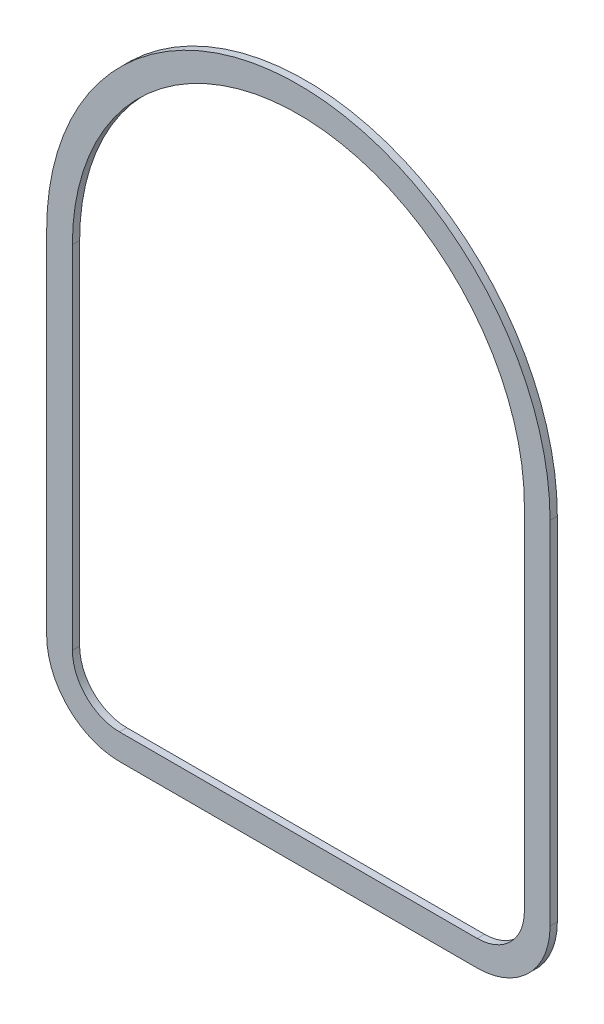
ISO-10303-21;
HEADER;
FILE_DESCRIPTION(('STEP AP214'),'2;1');
FILE_NAME('part.step','',(''),(''),'','','');
FILE_SCHEMA(('AUTOMOTIVE_DESIGN { 1 0 10303 214 1 1 1 1 }'));
ENDSEC;
DATA;
#1=APPLICATION_CONTEXT('core data for automotive mechanical design processes');
#2=APPLICATION_PROTOCOL_DEFINITION('international standard','automotive_design',2000,#1);
#3=PRODUCT_CONTEXT('',#1,'mechanical');
#4=PRODUCT('Part','Part','',(#3));
#5=PRODUCT_RELATED_PRODUCT_CATEGORY('part','',(#4));
#6=PRODUCT_DEFINITION_FORMATION('','',#4);
#7=PRODUCT_DEFINITION_CONTEXT('part definition',#1,'design');
#8=PRODUCT_DEFINITION('design','',#6,#7);
#9=PRODUCT_DEFINITION_SHAPE('','',#8);
#10=(LENGTH_UNIT() NAMED_UNIT(*) SI_UNIT(.MILLI.,.METRE.));
#11=(NAMED_UNIT(*) PLANE_ANGLE_UNIT() SI_UNIT($,.RADIAN.));
#12=(NAMED_UNIT(*) SI_UNIT($,.STERADIAN.) SOLID_ANGLE_UNIT());
#13=UNCERTAINTY_MEASURE_WITH_UNIT(LENGTH_MEASURE(1.E-05),#10,'distance_accuracy_value','');
#14=(GEOMETRIC_REPRESENTATION_CONTEXT(3) GLOBAL_UNCERTAINTY_ASSIGNED_CONTEXT((#13)) GLOBAL_UNIT_ASSIGNED_CONTEXT((#10,
#11,#12)) REPRESENTATION_CONTEXT('',''));
#15=CARTESIAN_POINT('',(0.,0.,0.));
#16=DIRECTION('',(0.,0.,1.));
#17=DIRECTION('',(1.,0.,0.));
#18=AXIS2_PLACEMENT_3D('',#15,#16,#17);
#19=CARTESIAN_POINT('',(340.245573826653,1.17102259932156E-13,10.));
#20=DIRECTION('',(-1.,0.,0.));
#21=DIRECTION('',(0.,-1.,0.));
#22=AXIS2_PLACEMENT_3D('',#19,#20,#21);
#23=PLANE('',#22);
#24=DIRECTION('',(0.,1.,0.));
#25=VECTOR('',#24,1.);
#26=CARTESIAN_POINT('',(340.245573826653,1.17102259932156E-13,0.));
#27=LINE('',#26,#25);
#28=CARTESIAN_POINT('',(340.245573826653,-360.346945871874,0.));
#29=VERTEX_POINT('',#28);
#30=CARTESIAN_POINT('',(340.245573826653,123.523054128126,0.));
#31=VERTEX_POINT('',#30);
#32=EDGE_CURVE('E181',#29,#31,#27,.T.);
#33=ORIENTED_EDGE('',*,*,#32,.T.);
#34=DIRECTION('',(0.,0.,-1.));
#35=VECTOR('',#34,1.);
#36=CARTESIAN_POINT('',(340.245573826653,123.523054128126,10.));
#37=LINE('',#36,#35);
#38=CARTESIAN_POINT('',(340.245573826653,123.523054128126,10.));
#39=VERTEX_POINT('',#38);
#40=EDGE_CURVE('E11',#39,#31,#37,.T.);
#41=ORIENTED_EDGE('',*,*,#40,.F.);
#42=DIRECTION('',(0.,1.,0.));
#43=VECTOR('',#42,1.);
#44=CARTESIAN_POINT('',(340.245573826653,1.17102259932156E-13,10.));
#45=LINE('',#44,#43);
#46=CARTESIAN_POINT('',(340.245573826653,-360.346945871874,10.));
#47=VERTEX_POINT('',#46);
#48=EDGE_CURVE('E240',#47,#39,#45,.T.);
#49=ORIENTED_EDGE('',*,*,#48,.F.);
#50=DIRECTION('',(0.,0.,-1.));
#51=VECTOR('',#50,1.);
#52=CARTESIAN_POINT('',(340.245573826653,-360.346945871874,10.));
#53=LINE('',#52,#51);
#54=EDGE_CURVE('E193',#47,#29,#53,.T.);
#55=ORIENTED_EDGE('',*,*,#54,.T.);
#56=EDGE_LOOP('',(#33,#41,#49,#55));
#57=FACE_BOUND('',#56,.T.);
#58=ADVANCED_FACE('F38',(#57),#23,.F.);
#59=CARTESIAN_POINT('',(-6.46442617334697,123.523054128126,10.));
#60=DIRECTION('',(0.,0.,-1.));
#61=DIRECTION('',(-1.,0.,0.));
#62=AXIS2_PLACEMENT_3D('',#59,#60,#61);
#63=CYLINDRICAL_SURFACE('',#62,346.71);
#64=CARTESIAN_POINT('',(-6.46442617334697,123.523054128126,0.));
#65=DIRECTION('',(0.,0.,1.));
#66=DIRECTION('',(1.,0.,0.));
#67=AXIS2_PLACEMENT_3D('',#64,#65,#66);
#68=CIRCLE('',#67,346.71);
#69=CARTESIAN_POINT('',(-353.174426173347,123.523054128126,0.));
#70=VERTEX_POINT('',#69);
#71=EDGE_CURVE('E184',#31,#70,#68,.T.);
#72=ORIENTED_EDGE('',*,*,#71,.T.);
#73=DIRECTION('',(0.,0.,-1.));
#74=VECTOR('',#73,1.);
#75=CARTESIAN_POINT('',(-353.174426173347,123.523054128126,10.));
#76=LINE('',#75,#74);
#77=CARTESIAN_POINT('',(-353.174426173347,123.523054128126,10.));
#78=VERTEX_POINT('',#77);
#79=EDGE_CURVE('E48',#78,#70,#76,.T.);
#80=ORIENTED_EDGE('',*,*,#79,.F.);
#81=CARTESIAN_POINT('',(-6.46442617334697,123.523054128126,10.));
#82=DIRECTION('',(0.,0.,1.));
#83=DIRECTION('',(1.,0.,0.));
#84=AXIS2_PLACEMENT_3D('',#81,#82,#83);
#85=CIRCLE('',#84,346.71);
#86=EDGE_CURVE('E157',#39,#78,#85,.T.);
#87=ORIENTED_EDGE('',*,*,#86,.F.);
#88=ORIENTED_EDGE('',*,*,#40,.T.);
#89=EDGE_LOOP('',(#72,#80,#87,#88));
#90=FACE_BOUND('',#89,.T.);
#91=ADVANCED_FACE('F245',(#90),#63,.T.);
#92=CARTESIAN_POINT('',(-353.174426173347,0.,10.));
#93=DIRECTION('',(1.,0.,0.));
#94=DIRECTION('',(0.,0.,-1.));
#95=AXIS2_PLACEMENT_3D('',#92,#93,#94);
#96=PLANE('',#95);
#97=DIRECTION('',(0.,-1.,0.));
#98=VECTOR('',#97,1.);
#99=CARTESIAN_POINT('',(-353.174426173347,0.,0.));
#100=LINE('',#99,#98);
#101=CARTESIAN_POINT('',(-353.174426173347,-360.346945871874,0.));
#102=VERTEX_POINT('',#101);
#103=EDGE_CURVE('E186',#70,#102,#100,.T.);
#104=ORIENTED_EDGE('',*,*,#103,.T.);
#105=DIRECTION('',(0.,0.,-1.));
#106=VECTOR('',#105,1.);
#107=CARTESIAN_POINT('',(-353.174426173347,-360.346945871874,10.));
#108=LINE('',#107,#106);
#109=CARTESIAN_POINT('',(-353.174426173347,-360.346945871874,10.));
#110=VERTEX_POINT('',#109);
#111=EDGE_CURVE('E146',#110,#102,#108,.T.);
#112=ORIENTED_EDGE('',*,*,#111,.F.);
#113=DIRECTION('',(0.,-1.,0.));
#114=VECTOR('',#113,1.);
#115=CARTESIAN_POINT('',(-353.174426173347,0.,10.));
#116=LINE('',#115,#114);
#117=EDGE_CURVE('E154',#78,#110,#116,.T.);
#118=ORIENTED_EDGE('',*,*,#117,.F.);
#119=ORIENTED_EDGE('',*,*,#79,.T.);
#120=EDGE_LOOP('',(#104,#112,#118,#119));
#121=FACE_BOUND('',#120,.T.);
#122=ADVANCED_FACE('F248',(#121),#96,.F.);
#123=CARTESIAN_POINT('',(-252.844426173347,-360.346945871874,10.));
#124=DIRECTION('',(0.,0.,-1.));
#125=DIRECTION('',(-1.,0.,0.));
#126=AXIS2_PLACEMENT_3D('',#123,#124,#125);
#127=CYLINDRICAL_SURFACE('',#126,100.33);
#128=CARTESIAN_POINT('',(-252.844426173347,-360.346945871874,0.));
#129=DIRECTION('',(0.,0.,1.));
#130=DIRECTION('',(1.,0.,0.));
#131=AXIS2_PLACEMENT_3D('',#128,#129,#130);
#132=CIRCLE('',#131,100.33);
#133=CARTESIAN_POINT('',(-252.844426173347,-460.676945871874,0.));
#134=VERTEX_POINT('',#133);
#135=EDGE_CURVE('E145',#134,#102,#132,.F.);
#136=ORIENTED_EDGE('',*,*,#135,.F.);
#137=DIRECTION('',(0.,0.,-1.));
#138=VECTOR('',#137,1.);
#139=CARTESIAN_POINT('',(-252.844426173347,-460.676945871874,10.));
#140=LINE('',#139,#138);
#141=CARTESIAN_POINT('',(-252.844426173347,-460.676945871874,10.));
#142=VERTEX_POINT('',#141);
#143=EDGE_CURVE('E139',#142,#134,#140,.T.);
#144=ORIENTED_EDGE('',*,*,#143,.F.);
#145=CARTESIAN_POINT('',(-252.844426173347,-360.346945871874,10.));
#146=DIRECTION('',(0.,0.,1.));
#147=DIRECTION('',(1.,0.,0.));
#148=AXIS2_PLACEMENT_3D('',#145,#146,#147);
#149=CIRCLE('',#148,100.33);
#150=EDGE_CURVE('E143',#142,#110,#149,.F.);
#151=ORIENTED_EDGE('',*,*,#150,.T.);
#152=ORIENTED_EDGE('',*,*,#111,.T.);
#153=EDGE_LOOP('',(#136,#144,#151,#152));
#154=FACE_BOUND('',#153,.T.);
#155=ADVANCED_FACE('F141',(#154),#127,.T.);
#156=CARTESIAN_POINT('',(0.,-460.676945871874,10.));
#157=DIRECTION('',(0.,1.,0.));
#158=DIRECTION('',(-1.,0.,0.));
#159=AXIS2_PLACEMENT_3D('',#156,#157,#158);
#160=PLANE('',#159);
#161=DIRECTION('',(1.,0.,0.));
#162=VECTOR('',#161,1.);
#163=CARTESIAN_POINT('',(0.,-460.676945871874,0.));
#164=LINE('',#163,#162);
#165=CARTESIAN_POINT('',(239.915573826653,-460.676945871874,0.));
#166=VERTEX_POINT('',#165);
#167=EDGE_CURVE('E97',#134,#166,#164,.T.);
#168=ORIENTED_EDGE('',*,*,#167,.T.);
#169=DIRECTION('',(0.,0.,-1.));
#170=VECTOR('',#169,1.);
#171=CARTESIAN_POINT('',(239.915573826653,-460.676945871874,10.));
#172=LINE('',#171,#170);
#173=CARTESIAN_POINT('',(239.915573826653,-460.676945871874,10.));
#174=VERTEX_POINT('',#173);
#175=EDGE_CURVE('E147',#174,#166,#172,.T.);
#176=ORIENTED_EDGE('',*,*,#175,.F.);
#177=DIRECTION('',(1.,0.,0.));
#178=VECTOR('',#177,1.);
#179=CARTESIAN_POINT('',(0.,-460.676945871874,10.));
#180=LINE('',#179,#178);
#181=EDGE_CURVE('E149',#142,#174,#180,.T.);
#182=ORIENTED_EDGE('',*,*,#181,.F.);
#183=ORIENTED_EDGE('',*,*,#143,.T.);
#184=EDGE_LOOP('',(#168,#176,#182,#183));
#185=FACE_BOUND('',#184,.T.);
#186=ADVANCED_FACE('F150',(#185),#160,.F.);
#187=CARTESIAN_POINT('',(-6.46442617334697,123.523054128126,10.));
#188=DIRECTION('',(0.,0.,-1.));
#189=DIRECTION('',(-1.,0.,0.));
#190=AXIS2_PLACEMENT_3D('',#187,#188,#189);
#191=CYLINDRICAL_SURFACE('',#190,311.31);
#192=CARTESIAN_POINT('',(-6.46442617334697,123.523054128126,0.));
#193=DIRECTION('',(0.,0.,1.));
#194=DIRECTION('',(1.,0.,0.));
#195=AXIS2_PLACEMENT_3D('',#192,#193,#194);
#196=CIRCLE('',#195,311.31);
#197=CARTESIAN_POINT('',(304.845573826653,123.523054128126,0.));
#198=VERTEX_POINT('',#197);
#199=CARTESIAN_POINT('',(-317.774426173347,123.523054128126,0.));
#200=VERTEX_POINT('',#199);
#201=EDGE_CURVE('E163',#198,#200,#196,.T.);
#202=ORIENTED_EDGE('',*,*,#201,.F.);
#203=DIRECTION('',(0.,0.,-1.));
#204=VECTOR('',#203,1.);
#205=CARTESIAN_POINT('',(304.845573826653,123.523054128126,10.));
#206=LINE('',#205,#204);
#207=CARTESIAN_POINT('',(304.845573826653,123.523054128126,10.));
#208=VERTEX_POINT('',#207);
#209=EDGE_CURVE('E42',#208,#198,#206,.T.);
#210=ORIENTED_EDGE('',*,*,#209,.F.);
#211=CARTESIAN_POINT('',(-6.46442617334697,123.523054128126,10.));
#212=DIRECTION('',(0.,0.,1.));
#213=DIRECTION('',(1.,0.,0.));
#214=AXIS2_PLACEMENT_3D('',#211,#212,#213);
#215=CIRCLE('',#214,311.31);
#216=CARTESIAN_POINT('',(-317.774426173347,123.523054128126,10.));
#217=VERTEX_POINT('',#216);
#218=EDGE_CURVE('E192',#208,#217,#215,.T.);
#219=ORIENTED_EDGE('',*,*,#218,.T.);
#220=DIRECTION('',(0.,0.,-1.));
#221=VECTOR('',#220,1.);
#222=CARTESIAN_POINT('',(-317.774426173347,123.523054128126,10.));
#223=LINE('',#222,#221);
#224=EDGE_CURVE('E162',#217,#200,#223,.T.);
#225=ORIENTED_EDGE('',*,*,#224,.T.);
#226=EDGE_LOOP('',(#202,#210,#219,#225));
#227=FACE_BOUND('',#226,.T.);
#228=ADVANCED_FACE('F40',(#227),#191,.F.);
#229=CARTESIAN_POINT('',(304.845573826653,1.04918648092696E-13,10.));
#230=DIRECTION('',(-1.,0.,0.));
#231=DIRECTION('',(0.,-1.,0.));
#232=AXIS2_PLACEMENT_3D('',#229,#230,#231);
#233=PLANE('',#232);
#234=DIRECTION('',(0.,1.,0.));
#235=VECTOR('',#234,1.);
#236=CARTESIAN_POINT('',(304.845573826653,1.04918648092696E-13,0.));
#237=LINE('',#236,#235);
#238=CARTESIAN_POINT('',(304.845573826653,-360.346945871874,0.));
#239=VERTEX_POINT('',#238);
#240=EDGE_CURVE('E166',#239,#198,#237,.T.);
#241=ORIENTED_EDGE('',*,*,#240,.F.);
#242=DIRECTION('',(0.,0.,-1.));
#243=VECTOR('',#242,1.);
#244=CARTESIAN_POINT('',(304.845573826653,-360.346945871874,10.));
#245=LINE('',#244,#243);
#246=CARTESIAN_POINT('',(304.845573826653,-360.346945871874,10.));
#247=VERTEX_POINT('',#246);
#248=EDGE_CURVE('E205',#247,#239,#245,.T.);
#249=ORIENTED_EDGE('',*,*,#248,.F.);
#250=DIRECTION('',(0.,1.,0.));
#251=VECTOR('',#250,1.);
#252=CARTESIAN_POINT('',(304.845573826653,1.04918648092696E-13,10.));
#253=LINE('',#252,#251);
#254=EDGE_CURVE('E214',#247,#208,#253,.T.);
#255=ORIENTED_EDGE('',*,*,#254,.T.);
#256=ORIENTED_EDGE('',*,*,#209,.T.);
#257=EDGE_LOOP('',(#241,#249,#255,#256));
#258=FACE_BOUND('',#257,.T.);
#259=ADVANCED_FACE('F212',(#258),#233,.T.);
#260=CARTESIAN_POINT('',(239.915573826653,-360.346945871874,10.));
#261=DIRECTION('',(0.,0.,-1.));
#262=DIRECTION('',(-1.,0.,0.));
#263=AXIS2_PLACEMENT_3D('',#260,#261,#262);
#264=CYLINDRICAL_SURFACE('',#263,64.9299999999999);
#265=CARTESIAN_POINT('',(239.915573826653,-360.346945871874,0.));
#266=DIRECTION('',(0.,0.,1.));
#267=DIRECTION('',(1.,0.,0.));
#268=AXIS2_PLACEMENT_3D('',#265,#266,#267);
#269=CIRCLE('',#268,64.9299999999999);
#270=CARTESIAN_POINT('',(239.915573826653,-425.276945871874,0.));
#271=VERTEX_POINT('',#270);
#272=EDGE_CURVE('E169',#271,#239,#269,.T.);
#273=ORIENTED_EDGE('',*,*,#272,.F.);
#274=DIRECTION('',(0.,0.,-1.));
#275=VECTOR('',#274,1.);
#276=CARTESIAN_POINT('',(239.915573826653,-425.276945871874,10.));
#277=LINE('',#276,#275);
#278=CARTESIAN_POINT('',(239.915573826653,-425.276945871874,10.));
#279=VERTEX_POINT('',#278);
#280=EDGE_CURVE('E204',#279,#271,#277,.T.);
#281=ORIENTED_EDGE('',*,*,#280,.F.);
#282=CARTESIAN_POINT('',(239.915573826653,-360.346945871874,10.));
#283=DIRECTION('',(0.,0.,1.));
#284=DIRECTION('',(1.,0.,0.));
#285=AXIS2_PLACEMENT_3D('',#282,#283,#284);
#286=CIRCLE('',#285,64.9299999999999);
#287=EDGE_CURVE('E223',#279,#247,#286,.T.);
#288=ORIENTED_EDGE('',*,*,#287,.T.);
#289=ORIENTED_EDGE('',*,*,#248,.T.);
#290=EDGE_LOOP('',(#273,#281,#288,#289));
#291=FACE_BOUND('',#290,.T.);
#292=ADVANCED_FACE('F221',(#291),#264,.F.);
#293=CARTESIAN_POINT('',(0.,-425.276945871874,10.));
#294=DIRECTION('',(0.,1.,0.));
#295=DIRECTION('',(-1.,0.,0.));
#296=AXIS2_PLACEMENT_3D('',#293,#294,#295);
#297=PLANE('',#296);
#298=DIRECTION('',(1.,0.,0.));
#299=VECTOR('',#298,1.);
#300=CARTESIAN_POINT('',(0.,-425.276945871874,0.));
#301=LINE('',#300,#299);
#302=CARTESIAN_POINT('',(-252.844426173347,-425.276945871874,0.));
#303=VERTEX_POINT('',#302);
#304=EDGE_CURVE('E172',#303,#271,#301,.T.);
#305=ORIENTED_EDGE('',*,*,#304,.F.);
#306=DIRECTION('',(0.,0.,-1.));
#307=VECTOR('',#306,1.);
#308=CARTESIAN_POINT('',(-252.844426173347,-425.276945871874,10.));
#309=LINE('',#308,#307);
#310=CARTESIAN_POINT('',(-252.844426173347,-425.276945871874,10.));
#311=VERTEX_POINT('',#310);
#312=EDGE_CURVE('E202',#311,#303,#309,.T.);
#313=ORIENTED_EDGE('',*,*,#312,.F.);
#314=DIRECTION('',(1.,0.,0.));
#315=VECTOR('',#314,1.);
#316=CARTESIAN_POINT('',(0.,-425.276945871874,10.));
#317=LINE('',#316,#315);
#318=EDGE_CURVE('E228',#311,#279,#317,.T.);
#319=ORIENTED_EDGE('',*,*,#318,.T.);
#320=ORIENTED_EDGE('',*,*,#280,.T.);
#321=EDGE_LOOP('',(#305,#313,#319,#320));
#322=FACE_BOUND('',#321,.T.);
#323=ADVANCED_FACE('F230',(#322),#297,.T.);
#324=CARTESIAN_POINT('',(-252.844426173347,-360.346945871874,10.));
#325=DIRECTION('',(0.,0.,-1.));
#326=DIRECTION('',(-1.,0.,0.));
#327=AXIS2_PLACEMENT_3D('',#324,#325,#326);
#328=CYLINDRICAL_SURFACE('',#327,64.93);
#329=CARTESIAN_POINT('',(-252.844426173347,-360.346945871874,0.));
#330=DIRECTION('',(0.,0.,1.));
#331=DIRECTION('',(1.,0.,0.));
#332=AXIS2_PLACEMENT_3D('',#329,#330,#331);
#333=CIRCLE('',#332,64.93);
#334=CARTESIAN_POINT('',(-317.774426173347,-360.346945871874,0.));
#335=VERTEX_POINT('',#334);
#336=EDGE_CURVE('E175',#303,#335,#333,.F.);
#337=ORIENTED_EDGE('',*,*,#336,.T.);
#338=DIRECTION('',(0.,0.,-1.));
#339=VECTOR('',#338,1.);
#340=CARTESIAN_POINT('',(-317.774426173347,-360.346945871874,10.));
#341=LINE('',#340,#339);
#342=CARTESIAN_POINT('',(-317.774426173347,-360.346945871874,10.));
#343=VERTEX_POINT('',#342);
#344=EDGE_CURVE('E200',#343,#335,#341,.T.);
#345=ORIENTED_EDGE('',*,*,#344,.F.);
#346=CARTESIAN_POINT('',(-252.844426173347,-360.346945871874,10.));
#347=DIRECTION('',(0.,0.,1.));
#348=DIRECTION('',(1.,0.,0.));
#349=AXIS2_PLACEMENT_3D('',#346,#347,#348);
#350=CIRCLE('',#349,64.93);
#351=EDGE_CURVE('E232',#311,#343,#350,.F.);
#352=ORIENTED_EDGE('',*,*,#351,.F.);
#353=ORIENTED_EDGE('',*,*,#312,.T.);
#354=EDGE_LOOP('',(#337,#345,#352,#353));
#355=FACE_BOUND('',#354,.T.);
#356=ADVANCED_FACE('F261',(#355),#328,.F.);
#357=CARTESIAN_POINT('',(-317.774426173347,0.,10.));
#358=DIRECTION('',(1.,0.,0.));
#359=DIRECTION('',(0.,0.,-1.));
#360=AXIS2_PLACEMENT_3D('',#357,#358,#359);
#361=PLANE('',#360);
#362=DIRECTION('',(0.,-1.,0.));
#363=VECTOR('',#362,1.);
#364=CARTESIAN_POINT('',(-317.774426173347,0.,0.));
#365=LINE('',#364,#363);
#366=EDGE_CURVE('E178',#200,#335,#365,.T.);
#367=ORIENTED_EDGE('',*,*,#366,.F.);
#368=ORIENTED_EDGE('',*,*,#224,.F.);
#369=DIRECTION('',(0.,-1.,0.));
#370=VECTOR('',#369,1.);
#371=CARTESIAN_POINT('',(-317.774426173347,0.,10.));
#372=LINE('',#371,#370);
#373=EDGE_CURVE('E234',#217,#343,#372,.T.);
#374=ORIENTED_EDGE('',*,*,#373,.T.);
#375=ORIENTED_EDGE('',*,*,#344,.T.);
#376=EDGE_LOOP('',(#367,#368,#374,#375));
#377=FACE_BOUND('',#376,.T.);
#378=ADVANCED_FACE('F253',(#377),#361,.T.);
#379=CARTESIAN_POINT('',(239.915573826653,-360.346945871874,10.));
#380=DIRECTION('',(0.,0.,-1.));
#381=DIRECTION('',(-1.,0.,0.));
#382=AXIS2_PLACEMENT_3D('',#379,#380,#381);
#383=CYLINDRICAL_SURFACE('',#382,100.33);
#384=CARTESIAN_POINT('',(239.915573826653,-360.346945871874,0.));
#385=DIRECTION('',(0.,0.,1.));
#386=DIRECTION('',(1.,0.,0.));
#387=AXIS2_PLACEMENT_3D('',#384,#385,#386);
#388=CIRCLE('',#387,100.33);
#389=EDGE_CURVE('E103',#166,#29,#388,.T.);
#390=ORIENTED_EDGE('',*,*,#389,.T.);
#391=ORIENTED_EDGE('',*,*,#54,.F.);
#392=CARTESIAN_POINT('',(239.915573826653,-360.346945871874,10.));
#393=DIRECTION('',(0.,0.,1.));
#394=DIRECTION('',(1.,0.,0.));
#395=AXIS2_PLACEMENT_3D('',#392,#393,#394);
#396=CIRCLE('',#395,100.33);
#397=EDGE_CURVE('E57',#174,#47,#396,.T.);
#398=ORIENTED_EDGE('',*,*,#397,.F.);
#399=ORIENTED_EDGE('',*,*,#175,.T.);
#400=EDGE_LOOP('',(#390,#391,#398,#399));
#401=FACE_BOUND('',#400,.T.);
#402=ADVANCED_FACE('F251',(#401),#383,.T.);
#403=CARTESIAN_POINT('',(0.,0.,10.));
#404=DIRECTION('',(0.,0.,1.));
#405=DIRECTION('',(1.,0.,0.));
#406=AXIS2_PLACEMENT_3D('',#403,#404,#405);
#407=PLANE('',#406);
#408=ORIENTED_EDGE('',*,*,#218,.F.);
#409=ORIENTED_EDGE('',*,*,#254,.F.);
#410=ORIENTED_EDGE('',*,*,#287,.F.);
#411=ORIENTED_EDGE('',*,*,#318,.F.);
#412=ORIENTED_EDGE('',*,*,#351,.T.);
#413=ORIENTED_EDGE('',*,*,#373,.F.);
#414=EDGE_LOOP('',(#408,#409,#410,#411,#412,#413));
#415=FACE_BOUND('',#414,.T.);
#416=ORIENTED_EDGE('',*,*,#48,.T.);
#417=ORIENTED_EDGE('',*,*,#86,.T.);
#418=ORIENTED_EDGE('',*,*,#117,.T.);
#419=ORIENTED_EDGE('',*,*,#150,.F.);
#420=ORIENTED_EDGE('',*,*,#181,.T.);
#421=ORIENTED_EDGE('',*,*,#397,.T.);
#422=EDGE_LOOP('',(#416,#417,#418,#419,#420,#421));
#423=FACE_BOUND('',#422,.T.);
#424=ADVANCED_FACE('F152',(#415,#423),#407,.T.);
#425=CARTESIAN_POINT('',(0.,0.,0.));
#426=DIRECTION('',(0.,0.,1.));
#427=DIRECTION('',(1.,0.,0.));
#428=AXIS2_PLACEMENT_3D('',#425,#426,#427);
#429=PLANE('',#428);
#430=ORIENTED_EDGE('',*,*,#201,.T.);
#431=ORIENTED_EDGE('',*,*,#366,.T.);
#432=ORIENTED_EDGE('',*,*,#336,.F.);
#433=ORIENTED_EDGE('',*,*,#304,.T.);
#434=ORIENTED_EDGE('',*,*,#272,.T.);
#435=ORIENTED_EDGE('',*,*,#240,.T.);
#436=EDGE_LOOP('',(#430,#431,#432,#433,#434,#435));
#437=FACE_BOUND('',#436,.T.);
#438=ORIENTED_EDGE('',*,*,#32,.F.);
#439=ORIENTED_EDGE('',*,*,#389,.F.);
#440=ORIENTED_EDGE('',*,*,#167,.F.);
#441=ORIENTED_EDGE('',*,*,#135,.T.);
#442=ORIENTED_EDGE('',*,*,#103,.F.);
#443=ORIENTED_EDGE('',*,*,#71,.F.);
#444=EDGE_LOOP('',(#438,#439,#440,#441,#442,#443));
#445=FACE_BOUND('',#444,.T.);
#446=ADVANCED_FACE('F217',(#437,#445),#429,.F.);
#447=CLOSED_SHELL('',(#58,#91,#122,#155,#186,#228,#259,#292,#323,#356,#378,#402,#424,#446));
#448=MANIFOLD_SOLID_BREP('B2',#447);
#449=ADVANCED_BREP_SHAPE_REPRESENTATION('',(#18,#448),#14);
#450=SHAPE_DEFINITION_REPRESENTATION(#9,#449);
ENDSEC;
END-ISO-10303-21;
